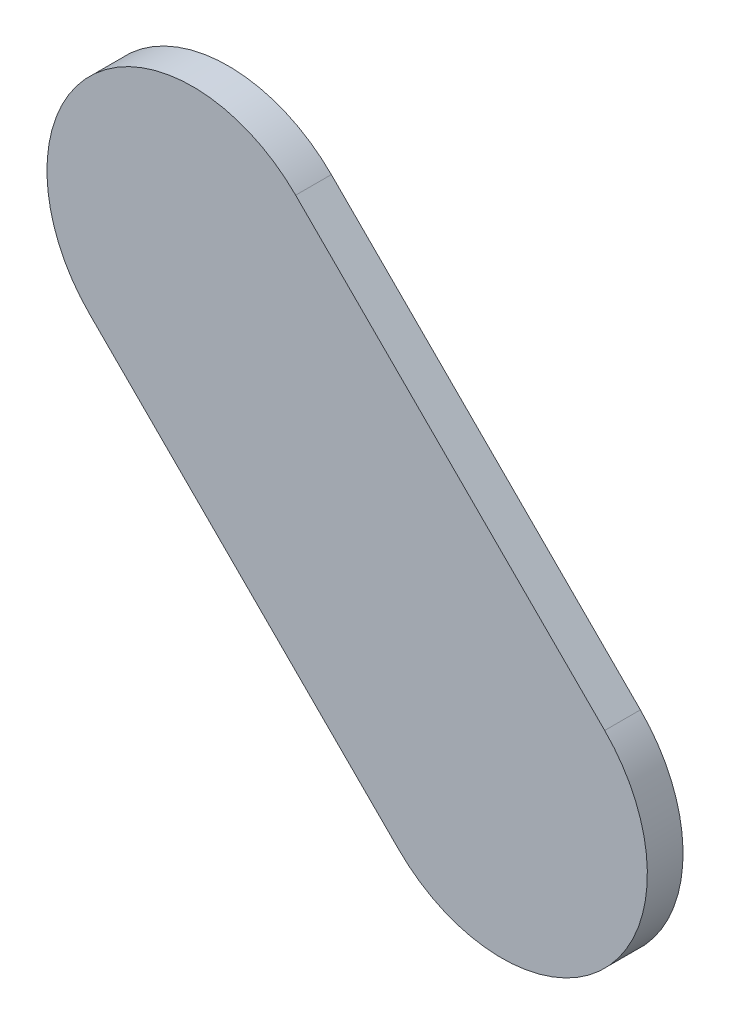
ISO-10303-21;
HEADER;
FILE_DESCRIPTION(('STEP AP214'),'2;1');
FILE_NAME('part.step','',(''),(''),'','','');
FILE_SCHEMA(('AUTOMOTIVE_DESIGN { 1 0 10303 214 1 1 1 1 }'));
ENDSEC;
DATA;
#1=APPLICATION_CONTEXT('core data for automotive mechanical design processes');
#2=APPLICATION_PROTOCOL_DEFINITION('international standard','automotive_design',2000,#1);
#3=PRODUCT_CONTEXT('',#1,'mechanical');
#4=PRODUCT('Part','Part','',(#3));
#5=PRODUCT_RELATED_PRODUCT_CATEGORY('part','',(#4));
#6=PRODUCT_DEFINITION_FORMATION('','',#4);
#7=PRODUCT_DEFINITION_CONTEXT('part definition',#1,'design');
#8=PRODUCT_DEFINITION('design','',#6,#7);
#9=PRODUCT_DEFINITION_SHAPE('','',#8);
#10=(LENGTH_UNIT() NAMED_UNIT(*) SI_UNIT(.MILLI.,.METRE.));
#11=(NAMED_UNIT(*) PLANE_ANGLE_UNIT() SI_UNIT($,.RADIAN.));
#12=(NAMED_UNIT(*) SI_UNIT($,.STERADIAN.) SOLID_ANGLE_UNIT());
#13=UNCERTAINTY_MEASURE_WITH_UNIT(LENGTH_MEASURE(1.E-05),#10,'distance_accuracy_value','');
#14=(GEOMETRIC_REPRESENTATION_CONTEXT(3) GLOBAL_UNCERTAINTY_ASSIGNED_CONTEXT((#13)) GLOBAL_UNIT_ASSIGNED_CONTEXT((#10,
#11,#12)) REPRESENTATION_CONTEXT('',''));
#15=CARTESIAN_POINT('',(0.,0.,0.));
#16=DIRECTION('',(0.,0.,1.));
#17=DIRECTION('',(1.,0.,0.));
#18=AXIS2_PLACEMENT_3D('',#15,#16,#17);
#19=CARTESIAN_POINT('',(2.311714999684,5.557270704874,0.76487));
#20=DIRECTION('',(0.,0.,-1.));
#21=DIRECTION('',(-1.,0.,0.));
#22=AXIS2_PLACEMENT_3D('',#19,#20,#21);
#23=PLANE('',#22);
#24=DIRECTION('',(0.707105988327103,-0.707107574045103,0.));
#25=VECTOR('',#24,1.);
#26=CARTESIAN_POINT('',(2.262324333001,5.804132333,0.76487));
#27=LINE('',#26,#25);
#28=CARTESIAN_POINT('',(2.26232436318415,5.80413230281701,0.76487));
#29=VERTEX_POINT('',#28);
#30=CARTESIAN_POINT('',(2.55930888899983,5.50714711099952,0.76487));
#31=VERTEX_POINT('',#30);
#32=EDGE_CURVE('E54',#29,#31,#27,.T.);
#33=ORIENTED_EDGE('',*,*,#32,.T.);
#34=CARTESIAN_POINT('',(2.460314,5.408152,0.76487));
#35=DIRECTION('',(0.,0.,1.));
#36=DIRECTION('',(1.,0.,0.));
#37=AXIS2_PLACEMENT_3D('',#34,#35,#36);
#38=CIRCLE('',#37,0.140000071608);
#39=CARTESIAN_POINT('',(2.36131908081826,5.30915758518393,0.76487));
#40=VERTEX_POINT('',#39);
#41=EDGE_CURVE('E20',#40,#31,#38,.T.);
#42=ORIENTED_EDGE('',*,*,#41,.F.);
#43=DIRECTION('',(-0.707107574045603,0.707105988326603,0.));
#44=VECTOR('',#43,1.);
#45=CARTESIAN_POINT('',(2.361319000001,5.309157666001,0.76487));
#46=LINE('',#45,#44);
#47=CARTESIAN_POINT('',(2.06433388900028,5.60614211099989,0.76487));
#48=VERTEX_POINT('',#47);
#49=EDGE_CURVE('E78',#40,#48,#46,.T.);
#50=ORIENTED_EDGE('',*,*,#49,.T.);
#51=CARTESIAN_POINT('',(2.163328667,5.705137333,0.76487));
#52=DIRECTION('',(0.,0.,1.));
#53=DIRECTION('',(1.,0.,0.));
#54=AXIS2_PLACEMENT_3D('',#51,#52,#53);
#55=CIRCLE('',#54,0.140000071608);
#56=EDGE_CURVE('E58',#29,#48,#55,.T.);
#57=ORIENTED_EDGE('',*,*,#56,.F.);
#58=EDGE_LOOP('',(#33,#42,#50,#57));
#59=FACE_BOUND('',#58,.T.);
#60=ADVANCED_FACE('F17',(#59),#23,.T.);
#61=CARTESIAN_POINT('',(2.460314,5.408152,0.76487));
#62=DIRECTION('',(0.,0.,1.));
#63=DIRECTION('',(1.,0.,0.));
#64=AXIS2_PLACEMENT_3D('',#61,#62,#63);
#65=CYLINDRICAL_SURFACE('',#64,0.140000071608);
#66=ORIENTED_EDGE('',*,*,#41,.T.);
#67=DIRECTION('',(0.,0.,1.));
#68=VECTOR('',#67,1.);
#69=CARTESIAN_POINT('',(2.55930866699992,5.50714733299992,0.76487));
#70=LINE('',#69,#68);
#71=CARTESIAN_POINT('',(2.55930888899988,5.50714711099959,0.79916));
#72=VERTEX_POINT('',#71);
#73=EDGE_CURVE('E62',#31,#72,#70,.T.);
#74=ORIENTED_EDGE('',*,*,#73,.T.);
#75=CARTESIAN_POINT('',(2.460314000001,5.408152564733,0.79916));
#76=DIRECTION('',(0.,0.,1.));
#77=DIRECTION('',(1.,0.,0.));
#78=AXIS2_PLACEMENT_3D('',#75,#76,#77);
#79=CIRCLE('',#78,0.14);
#80=CARTESIAN_POINT('',(2.36131908081829,5.30915758518389,0.79916));
#81=VERTEX_POINT('',#80);
#82=EDGE_CURVE('E82',#81,#72,#79,.T.);
#83=ORIENTED_EDGE('',*,*,#82,.F.);
#84=DIRECTION('',(0.,0.,1.));
#85=VECTOR('',#84,1.);
#86=CARTESIAN_POINT('',(2.361319000001,5.309157666001,0.76487));
#87=LINE('',#86,#85);
#88=EDGE_CURVE('E69',#81,#40,#87,.F.);
#89=ORIENTED_EDGE('',*,*,#88,.T.);
#90=EDGE_LOOP('',(#66,#74,#83,#89));
#91=FACE_BOUND('',#90,.T.);
#92=ADVANCED_FACE('F66',(#91),#65,.T.);
#93=CARTESIAN_POINT('',(2.262324333001,5.804132333,0.76487));
#94=DIRECTION('',(-0.707107574045103,-0.707105988327103,0.));
#95=DIRECTION('',(0.707105988327103,-0.707107574045103,0.));
#96=AXIS2_PLACEMENT_3D('',#93,#94,#95);
#97=PLANE('',#96);
#98=ORIENTED_EDGE('',*,*,#73,.F.);
#99=ORIENTED_EDGE('',*,*,#32,.F.);
#100=DIRECTION('',(0.,0.,1.));
#101=VECTOR('',#100,1.);
#102=CARTESIAN_POINT('',(2.26232433300123,5.80413233300023,0.76487));
#103=LINE('',#102,#101);
#104=CARTESIAN_POINT('',(2.26232436318413,5.80413230281703,0.79916));
#105=VERTEX_POINT('',#104);
#106=EDGE_CURVE('E73',#105,#29,#103,.F.);
#107=ORIENTED_EDGE('',*,*,#106,.F.);
#108=DIRECTION('',(-0.707105988327285,0.707107574044921,0.));
#109=VECTOR('',#108,1.);
#110=CARTESIAN_POINT('',(2.559308667,5.507147333,0.79916));
#111=LINE('',#110,#109);
#112=EDGE_CURVE('E72',#72,#105,#111,.T.);
#113=ORIENTED_EDGE('',*,*,#112,.F.);
#114=EDGE_LOOP('',(#98,#99,#107,#113));
#115=FACE_BOUND('',#114,.T.);
#116=ADVANCED_FACE('F71',(#115),#97,.F.);
#117=CARTESIAN_POINT('',(2.163328667,5.705137333,0.76487));
#118=DIRECTION('',(0.,0.,1.));
#119=DIRECTION('',(1.,0.,0.));
#120=AXIS2_PLACEMENT_3D('',#117,#118,#119);
#121=CYLINDRICAL_SURFACE('',#120,0.140000071608);
#122=ORIENTED_EDGE('',*,*,#56,.T.);
#123=DIRECTION('',(0.,0.,1.));
#124=VECTOR('',#123,1.);
#125=CARTESIAN_POINT('',(2.06433400000021,5.60614200000021,0.76487));
#126=LINE('',#125,#124);
#127=CARTESIAN_POINT('',(2.06433388900021,5.60614211099975,0.79916));
#128=VERTEX_POINT('',#127);
#129=EDGE_CURVE('E79',#48,#128,#126,.T.);
#130=ORIENTED_EDGE('',*,*,#129,.T.);
#131=CARTESIAN_POINT('',(2.163329,5.705137101268,0.79916));
#132=DIRECTION('',(0.,0.,1.));
#133=DIRECTION('',(1.,0.,0.));
#134=AXIS2_PLACEMENT_3D('',#131,#132,#133);
#135=CIRCLE('',#134,0.140000470934);
#136=EDGE_CURVE('E26',#105,#128,#135,.T.);
#137=ORIENTED_EDGE('',*,*,#136,.F.);
#138=ORIENTED_EDGE('',*,*,#106,.T.);
#139=EDGE_LOOP('',(#122,#130,#137,#138));
#140=FACE_BOUND('',#139,.T.);
#141=ADVANCED_FACE('F91',(#140),#121,.T.);
#142=CARTESIAN_POINT('',(2.361319000001,5.309157666001,0.76487));
#143=DIRECTION('',(0.707105988326603,0.707107574045603,0.));
#144=DIRECTION('',(-0.707107574045603,0.707105988326603,0.));
#145=AXIS2_PLACEMENT_3D('',#142,#143,#144);
#146=PLANE('',#145);
#147=ORIENTED_EDGE('',*,*,#129,.F.);
#148=ORIENTED_EDGE('',*,*,#49,.F.);
#149=ORIENTED_EDGE('',*,*,#88,.F.);
#150=DIRECTION('',(0.70710757404611,-0.707105988326096,0.));
#151=VECTOR('',#150,1.);
#152=CARTESIAN_POINT('',(2.064334,5.606142,0.79916));
#153=LINE('',#152,#151);
#154=EDGE_CURVE('E11',#128,#81,#153,.T.);
#155=ORIENTED_EDGE('',*,*,#154,.F.);
#156=EDGE_LOOP('',(#147,#148,#149,#155));
#157=FACE_BOUND('',#156,.T.);
#158=ADVANCED_FACE('F90',(#157),#146,.F.);
#159=CARTESIAN_POINT('',(2.311714999684,5.557270704874,0.79916));
#160=DIRECTION('',(0.,0.,1.));
#161=DIRECTION('',(1.,0.,0.));
#162=AXIS2_PLACEMENT_3D('',#159,#160,#161);
#163=PLANE('',#162);
#164=ORIENTED_EDGE('',*,*,#136,.T.);
#165=ORIENTED_EDGE('',*,*,#154,.T.);
#166=ORIENTED_EDGE('',*,*,#82,.T.);
#167=ORIENTED_EDGE('',*,*,#112,.T.);
#168=EDGE_LOOP('',(#164,#165,#166,#167));
#169=FACE_BOUND('',#168,.T.);
#170=ADVANCED_FACE('F87',(#169),#163,.T.);
#171=CLOSED_SHELL('',(#60,#92,#116,#141,#158,#170));
#172=MANIFOLD_SOLID_BREP('B1',#171);
#173=ADVANCED_BREP_SHAPE_REPRESENTATION('',(#18,#172),#14);
#174=SHAPE_DEFINITION_REPRESENTATION(#9,#173);
ENDSEC;
END-ISO-10303-21;
